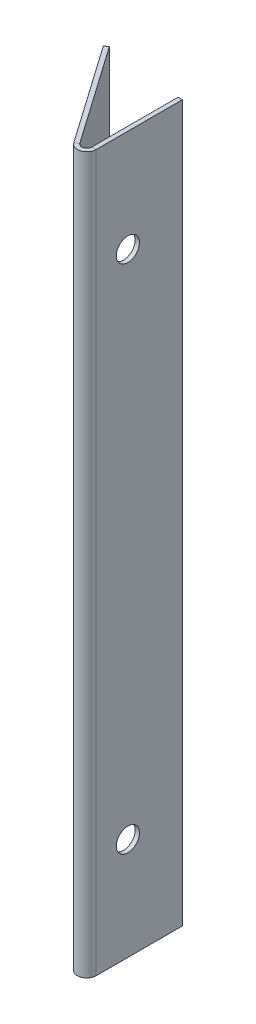
ISO-10303-21;
HEADER;
FILE_DESCRIPTION(('STEP AP214'),'2;1');
FILE_NAME('part.step','',(''),(''),'','','');
FILE_SCHEMA(('AUTOMOTIVE_DESIGN { 1 0 10303 214 1 1 1 1 }'));
ENDSEC;
DATA;
#1=APPLICATION_CONTEXT('core data for automotive mechanical design processes');
#2=APPLICATION_PROTOCOL_DEFINITION('international standard','automotive_design',2000,#1);
#3=PRODUCT_CONTEXT('',#1,'mechanical');
#4=PRODUCT('Part','Part','',(#3));
#5=PRODUCT_RELATED_PRODUCT_CATEGORY('part','',(#4));
#6=PRODUCT_DEFINITION_FORMATION('','',#4);
#7=PRODUCT_DEFINITION_CONTEXT('part definition',#1,'design');
#8=PRODUCT_DEFINITION('design','',#6,#7);
#9=PRODUCT_DEFINITION_SHAPE('','',#8);
#10=(LENGTH_UNIT() NAMED_UNIT(*) SI_UNIT(.MILLI.,.METRE.));
#11=(NAMED_UNIT(*) PLANE_ANGLE_UNIT() SI_UNIT($,.RADIAN.));
#12=(NAMED_UNIT(*) SI_UNIT($,.STERADIAN.) SOLID_ANGLE_UNIT());
#13=UNCERTAINTY_MEASURE_WITH_UNIT(LENGTH_MEASURE(1.E-05),#10,'distance_accuracy_value','');
#14=(GEOMETRIC_REPRESENTATION_CONTEXT(3) GLOBAL_UNCERTAINTY_ASSIGNED_CONTEXT((#13)) GLOBAL_UNIT_ASSIGNED_CONTEXT((#10,
#11,#12)) REPRESENTATION_CONTEXT('',''));
#15=CARTESIAN_POINT('',(0.,0.,0.));
#16=DIRECTION('',(0.,0.,1.));
#17=DIRECTION('',(1.,0.,0.));
#18=AXIS2_PLACEMENT_3D('',#15,#16,#17);
#19=CARTESIAN_POINT('',(-0.946252943629408,0.,0.662573444182441));
#20=DIRECTION('',(-0.819152044288991,0.,0.573576436351047));
#21=DIRECTION('',(0.573576436351047,0.,0.819152044288991));
#22=AXIS2_PLACEMENT_3D('',#19,#20,#21);
#23=PLANE('',#22);
#24=CARTESIAN_POINT('',(-6.31164463133152,-15.,-7.00000000000001));
#25=DIRECTION('',(-0.819152044288991,0.,0.573576436351047));
#26=DIRECTION('',(0.573576436351047,0.,0.819152044288991));
#27=AXIS2_PLACEMENT_3D('',#24,#25,#26);
#28=ELLIPSE('',#27,3.66232376628437,3.);
#29=CARTESIAN_POINT('',(-6.18412947346153,-17.9944675251264,-6.81788948145859));
#30=VERTEX_POINT('',#29);
#31=CARTESIAN_POINT('',(-6.18412947346153,-12.0055324748736,-6.81788948145859));
#32=VERTEX_POINT('',#31);
#33=EDGE_CURVE('E53',#30,#32,#28,.F.);
#34=ORIENTED_EDGE('',*,*,#33,.T.);
#35=CARTESIAN_POINT('',(-6.0566143155915,-15.,-6.6357789629171));
#36=DIRECTION('',(-0.819152044288991,0.,0.573576436351047));
#37=DIRECTION('',(0.573576436351047,0.,0.819152044288991));
#38=AXIS2_PLACEMENT_3D('',#35,#36,#37);
#39=ELLIPSE('',#38,3.66232376628437,3.);
#40=EDGE_CURVE('E131',#32,#30,#39,.F.);
#41=ORIENTED_EDGE('',*,*,#40,.T.);
#42=EDGE_LOOP('',(#34,#41));
#43=FACE_BOUND('',#42,.T.);
#44=CARTESIAN_POINT('',(-6.31164463133152,-90.,-7.00000000000002));
#45=DIRECTION('',(-0.819152044288991,0.,0.573576436351047));
#46=DIRECTION('',(0.573576436351047,0.,0.819152044288991));
#47=AXIS2_PLACEMENT_3D('',#44,#45,#46);
#48=ELLIPSE('',#47,3.66232376628437,3.);
#49=CARTESIAN_POINT('',(-6.1841294734616,-92.9944675251264,-6.81788948145869));
#50=VERTEX_POINT('',#49);
#51=CARTESIAN_POINT('',(-6.1841294734616,-87.0055324748736,-6.81788948145869));
#52=VERTEX_POINT('',#51);
#53=EDGE_CURVE('E165',#50,#52,#48,.F.);
#54=ORIENTED_EDGE('',*,*,#53,.T.);
#55=CARTESIAN_POINT('',(-6.0566143155915,-90.,-6.63577896291711));
#56=DIRECTION('',(-0.819152044288991,0.,0.573576436351047));
#57=DIRECTION('',(0.573576436351047,0.,0.819152044288991));
#58=AXIS2_PLACEMENT_3D('',#55,#56,#57);
#59=ELLIPSE('',#58,3.66232376628437,3.);
#60=EDGE_CURVE('E143',#52,#50,#59,.F.);
#61=ORIENTED_EDGE('',*,*,#60,.T.);
#62=EDGE_LOOP('',(#54,#61));
#63=FACE_BOUND('',#62,.T.);
#64=DIRECTION('',(-0.573576436351047,0.,-0.819152044288991));
#65=VECTOR('',#64,1.);
#66=CARTESIAN_POINT('',(-12.6266902751445,-105.,-16.0188198486969));
#67=LINE('',#66,#65);
#68=CARTESIAN_POINT('',(-2.49514894394678,-105.,-1.54947929132165));
#69=VERTEX_POINT('',#68);
#70=CARTESIAN_POINT('',(-12.6266902751445,-105.,-16.0188198486969));
#71=VERTEX_POINT('',#70);
#72=EDGE_CURVE('E195',#69,#71,#67,.T.);
#73=ORIENTED_EDGE('',*,*,#72,.F.);
#74=DIRECTION('',(0.,1.,0.));
#75=VECTOR('',#74,1.);
#76=CARTESIAN_POINT('',(-2.49514894394678,0.,-1.54947929132164));
#77=LINE('',#76,#75);
#78=CARTESIAN_POINT('',(-2.49514894394678,0.,-1.54947929132164));
#79=VERTEX_POINT('',#78);
#80=EDGE_CURVE('E189',#69,#79,#77,.T.);
#81=ORIENTED_EDGE('',*,*,#80,.T.);
#82=DIRECTION('',(0.573576436351047,0.,0.819152044288991));
#83=VECTOR('',#82,1.);
#84=CARTESIAN_POINT('',(-1.15516154812351,0.,0.364221037082915));
#85=LINE('',#84,#83);
#86=CARTESIAN_POINT('',(-12.6266902751445,0.,-16.0188198486969));
#87=VERTEX_POINT('',#86);
#88=EDGE_CURVE('E201',#87,#79,#85,.T.);
#89=ORIENTED_EDGE('',*,*,#88,.F.);
#90=DIRECTION('',(0.,1.,0.));
#91=VECTOR('',#90,1.);
#92=CARTESIAN_POINT('',(-12.6266902751445,0.,-16.0188198486969));
#93=LINE('',#92,#91);
#94=EDGE_CURVE('E197',#71,#87,#93,.T.);
#95=ORIENTED_EDGE('',*,*,#94,.F.);
#96=EDGE_LOOP('',(#73,#81,#89,#95));
#97=FACE_BOUND('',#96,.T.);
#98=ADVANCED_FACE('F38',(#43,#63,#97),#23,.T.);
#99=CARTESIAN_POINT('',(-0.426091395505899,0.,0.298352407099526));
#100=DIRECTION('',(-0.819152044288991,0.,0.573576436351047));
#101=DIRECTION('',(0.573576436351047,0.,0.819152044288991));
#102=AXIS2_PLACEMENT_3D('',#99,#100,#101);
#103=PLANE('',#102);
#104=CARTESIAN_POINT('',(-5.53645276746799,-15.,-7.00000000000001));
#105=DIRECTION('',(-0.819152044288991,0.,0.573576436351047));
#106=DIRECTION('',(0.573576436351047,0.,0.819152044288991));
#107=AXIS2_PLACEMENT_3D('',#104,#105,#106);
#108=ELLIPSE('',#107,3.66232376628437,3.);
#109=CARTESIAN_POINT('',(-5.66396792533802,-12.0055324748736,-7.1821105185415));
#110=VERTEX_POINT('',#109);
#111=CARTESIAN_POINT('',(-5.66396792533802,-17.9944675251264,-7.1821105185415));
#112=VERTEX_POINT('',#111);
#113=EDGE_CURVE('E134',#110,#112,#108,.F.);
#114=ORIENTED_EDGE('',*,*,#113,.F.);
#115=CARTESIAN_POINT('',(-5.79148308320801,-15.,-7.36422103708293));
#116=DIRECTION('',(-0.819152044288991,0.,0.573576436351047));
#117=DIRECTION('',(0.573576436351047,0.,0.819152044288991));
#118=AXIS2_PLACEMENT_3D('',#115,#116,#117);
#119=ELLIPSE('',#118,3.66232376628437,3.);
#120=EDGE_CURVE('E58',#112,#110,#119,.F.);
#121=ORIENTED_EDGE('',*,*,#120,.F.);
#122=EDGE_LOOP('',(#114,#121));
#123=FACE_BOUND('',#122,.T.);
#124=CARTESIAN_POINT('',(-5.53645276746799,-90.,-7.00000000000002));
#125=DIRECTION('',(-0.819152044288991,0.,0.573576436351047));
#126=DIRECTION('',(0.573576436351047,0.,0.819152044288991));
#127=AXIS2_PLACEMENT_3D('',#124,#125,#126);
#128=ELLIPSE('',#127,3.66232376628437,3.);
#129=CARTESIAN_POINT('',(-5.66396792533809,-87.0055324748736,-7.18211051854161));
#130=VERTEX_POINT('',#129);
#131=CARTESIAN_POINT('',(-5.66396792533809,-92.9944675251264,-7.18211051854161));
#132=VERTEX_POINT('',#131);
#133=EDGE_CURVE('E138',#130,#132,#128,.F.);
#134=ORIENTED_EDGE('',*,*,#133,.F.);
#135=CARTESIAN_POINT('',(-5.79148308320801,-90.,-7.36422103708294));
#136=DIRECTION('',(-0.819152044288991,0.,0.573576436351047));
#137=DIRECTION('',(0.573576436351047,0.,0.819152044288991));
#138=AXIS2_PLACEMENT_3D('',#135,#136,#137);
#139=ELLIPSE('',#138,3.66232376628437,3.);
#140=EDGE_CURVE('E166',#132,#130,#139,.F.);
#141=ORIENTED_EDGE('',*,*,#140,.F.);
#142=EDGE_LOOP('',(#134,#141));
#143=FACE_BOUND('',#142,.T.);
#144=DIRECTION('',(0.,1.,0.));
#145=VECTOR('',#144,1.);
#146=CARTESIAN_POINT('',(-1.97498739582327,-105.,-1.91370032840457));
#147=LINE('',#146,#145);
#148=CARTESIAN_POINT('',(-1.97498739582327,-105.,-1.91370032840456));
#149=VERTEX_POINT('',#148);
#150=CARTESIAN_POINT('',(-1.97498739582327,0.,-1.91370032840456));
#151=VERTEX_POINT('',#150);
#152=EDGE_CURVE('E184',#149,#151,#147,.T.);
#153=ORIENTED_EDGE('',*,*,#152,.F.);
#154=DIRECTION('',(-0.573576436351047,0.,-0.819152044288991));
#155=VECTOR('',#154,1.);
#156=CARTESIAN_POINT('',(-12.1065287270209,-105.,-16.3830408857798));
#157=LINE('',#156,#155);
#158=CARTESIAN_POINT('',(-12.1065287270209,-105.,-16.3830408857798));
#159=VERTEX_POINT('',#158);
#160=EDGE_CURVE('E194',#149,#159,#157,.T.);
#161=ORIENTED_EDGE('',*,*,#160,.T.);
#162=DIRECTION('',(0.,1.,0.));
#163=VECTOR('',#162,1.);
#164=CARTESIAN_POINT('',(-12.1065287270209,0.,-16.3830408857798));
#165=LINE('',#164,#163);
#166=CARTESIAN_POINT('',(-12.1065287270209,0.,-16.3830408857798));
#167=VERTEX_POINT('',#166);
#168=EDGE_CURVE('E206',#159,#167,#165,.T.);
#169=ORIENTED_EDGE('',*,*,#168,.T.);
#170=DIRECTION('',(0.573576436351047,0.,0.819152044288991));
#171=VECTOR('',#170,1.);
#172=CARTESIAN_POINT('',(-0.635,0.,0.));
#173=LINE('',#172,#171);
#174=EDGE_CURVE('E198',#167,#151,#173,.T.);
#175=ORIENTED_EDGE('',*,*,#174,.T.);
#176=EDGE_LOOP('',(#153,#161,#169,#175));
#177=FACE_BOUND('',#176,.T.);
#178=ADVANCED_FACE('F289',(#123,#143,#177),#103,.F.);
#179=CARTESIAN_POINT('',(-0.635,0.,0.));
#180=DIRECTION('',(1.,0.,0.));
#181=DIRECTION('',(0.,0.,-1.));
#182=AXIS2_PLACEMENT_3D('',#179,#180,#181);
#183=PLANE('',#182);
#184=CARTESIAN_POINT('',(-0.635,-15.,-7.00000000000001));
#185=DIRECTION('',(1.,0.,0.));
#186=DIRECTION('',(0.,0.,-1.));
#187=AXIS2_PLACEMENT_3D('',#184,#185,#186);
#188=CIRCLE('',#187,1.7);
#189=CARTESIAN_POINT('',(-0.635,-15.,-8.70000000000001));
#190=VERTEX_POINT('',#189);
#191=EDGE_CURVE('E178',#190,#190,#188,.T.);
#192=ORIENTED_EDGE('',*,*,#191,.T.);
#193=EDGE_LOOP('',(#192));
#194=FACE_BOUND('',#193,.T.);
#195=DIRECTION('',(0.,1.,0.));
#196=VECTOR('',#195,1.);
#197=CARTESIAN_POINT('',(-0.635000000000015,0.,-2.33619673142073));
#198=LINE('',#197,#196);
#199=CARTESIAN_POINT('',(-0.635000000000015,0.,-2.33619673142073));
#200=VERTEX_POINT('',#199);
#201=CARTESIAN_POINT('',(-0.635000000000015,-105.,-2.33619673142073));
#202=VERTEX_POINT('',#201);
#203=EDGE_CURVE('E229',#200,#202,#198,.F.);
#204=ORIENTED_EDGE('',*,*,#203,.F.);
#205=DIRECTION('',(0.,0.,1.));
#206=VECTOR('',#205,1.);
#207=CARTESIAN_POINT('',(-0.635,0.,0.));
#208=LINE('',#207,#206);
#209=CARTESIAN_POINT('',(-0.635,0.,-15.));
#210=VERTEX_POINT('',#209);
#211=EDGE_CURVE('E245',#210,#200,#208,.T.);
#212=ORIENTED_EDGE('',*,*,#211,.F.);
#213=DIRECTION('',(0.,1.,0.));
#214=VECTOR('',#213,1.);
#215=CARTESIAN_POINT('',(-0.635,0.,-15.));
#216=LINE('',#215,#214);
#217=CARTESIAN_POINT('',(-0.635,-105.,-15.));
#218=VERTEX_POINT('',#217);
#219=EDGE_CURVE('E241',#218,#210,#216,.T.);
#220=ORIENTED_EDGE('',*,*,#219,.F.);
#221=DIRECTION('',(0.,0.,-1.));
#222=VECTOR('',#221,1.);
#223=CARTESIAN_POINT('',(-0.635,-105.,0.));
#224=LINE('',#223,#222);
#225=EDGE_CURVE('E239',#202,#218,#224,.T.);
#226=ORIENTED_EDGE('',*,*,#225,.F.);
#227=EDGE_LOOP('',(#204,#212,#220,#226));
#228=FACE_BOUND('',#227,.T.);
#229=CARTESIAN_POINT('',(-0.635,-90.,-7.00000000000002));
#230=DIRECTION('',(1.,0.,0.));
#231=DIRECTION('',(0.,0.,-1.));
#232=AXIS2_PLACEMENT_3D('',#229,#230,#231);
#233=CIRCLE('',#232,1.7);
#234=CARTESIAN_POINT('',(-0.635,-90.,-8.70000000000003));
#235=VERTEX_POINT('',#234);
#236=EDGE_CURVE('E172',#235,#235,#233,.T.);
#237=ORIENTED_EDGE('',*,*,#236,.T.);
#238=EDGE_LOOP('',(#237));
#239=FACE_BOUND('',#238,.T.);
#240=ADVANCED_FACE('F272',(#194,#228,#239),#183,.F.);
#241=CARTESIAN_POINT('',(0.,0.,0.));
#242=DIRECTION('',(1.,0.,0.));
#243=DIRECTION('',(0.,0.,-1.));
#244=AXIS2_PLACEMENT_3D('',#241,#242,#243);
#245=PLANE('',#244);
#246=CARTESIAN_POINT('',(0.,-15.,-7.00000000000001));
#247=DIRECTION('',(1.,0.,0.));
#248=DIRECTION('',(0.,0.,-1.));
#249=AXIS2_PLACEMENT_3D('',#246,#247,#248);
#250=CIRCLE('',#249,1.7);
#251=CARTESIAN_POINT('',(0.,-15.,-8.70000000000001));
#252=VERTEX_POINT('',#251);
#253=EDGE_CURVE('E175',#252,#252,#250,.T.);
#254=ORIENTED_EDGE('',*,*,#253,.F.);
#255=EDGE_LOOP('',(#254));
#256=FACE_BOUND('',#255,.T.);
#257=DIRECTION('',(0.,0.,1.));
#258=VECTOR('',#257,1.);
#259=CARTESIAN_POINT('',(0.,0.,0.));
#260=LINE('',#259,#258);
#261=CARTESIAN_POINT('',(0.,0.,-15.));
#262=VERTEX_POINT('',#261);
#263=CARTESIAN_POINT('',(0.,0.,-2.33619673142073));
#264=VERTEX_POINT('',#263);
#265=EDGE_CURVE('E242',#262,#264,#260,.T.);
#266=ORIENTED_EDGE('',*,*,#265,.T.);
#267=DIRECTION('',(0.,1.,0.));
#268=VECTOR('',#267,1.);
#269=CARTESIAN_POINT('',(0.,0.,-2.33619673142073));
#270=LINE('',#269,#268);
#271=CARTESIAN_POINT('',(0.,-105.,-2.33619673142073));
#272=VERTEX_POINT('',#271);
#273=EDGE_CURVE('E216',#264,#272,#270,.F.);
#274=ORIENTED_EDGE('',*,*,#273,.T.);
#275=DIRECTION('',(0.,0.,-1.));
#276=VECTOR('',#275,1.);
#277=CARTESIAN_POINT('',(0.,-105.,0.));
#278=LINE('',#277,#276);
#279=CARTESIAN_POINT('',(0.,-105.,-15.));
#280=VERTEX_POINT('',#279);
#281=EDGE_CURVE('E236',#272,#280,#278,.T.);
#282=ORIENTED_EDGE('',*,*,#281,.T.);
#283=DIRECTION('',(0.,1.,0.));
#284=VECTOR('',#283,1.);
#285=CARTESIAN_POINT('',(0.,0.,-15.));
#286=LINE('',#285,#284);
#287=EDGE_CURVE('E249',#280,#262,#286,.T.);
#288=ORIENTED_EDGE('',*,*,#287,.T.);
#289=EDGE_LOOP('',(#266,#274,#282,#288));
#290=FACE_BOUND('',#289,.T.);
#291=CARTESIAN_POINT('',(0.,-90.,-7.00000000000002));
#292=DIRECTION('',(1.,0.,0.));
#293=DIRECTION('',(0.,0.,-1.));
#294=AXIS2_PLACEMENT_3D('',#291,#292,#293);
#295=CIRCLE('',#294,1.7);
#296=CARTESIAN_POINT('',(0.,-90.,-8.70000000000003));
#297=VERTEX_POINT('',#296);
#298=EDGE_CURVE('E168',#297,#297,#295,.T.);
#299=ORIENTED_EDGE('',*,*,#298,.F.);
#300=EDGE_LOOP('',(#299));
#301=FACE_BOUND('',#300,.T.);
#302=ADVANCED_FACE('F255',(#256,#290,#301),#245,.T.);
#303=CARTESIAN_POINT('',(-0.635,0.,0.));
#304=DIRECTION('',(0.,1.,0.));
#305=DIRECTION('',(0.,0.,1.));
#306=AXIS2_PLACEMENT_3D('',#303,#304,#305);
#307=PLANE('',#306);
#308=ORIENTED_EDGE('',*,*,#211,.T.);
#309=DIRECTION('',(1.,0.,0.));
#310=VECTOR('',#309,1.);
#311=CARTESIAN_POINT('',(-0.635000000000015,0.,-2.33619673142073));
#312=LINE('',#311,#310);
#313=EDGE_CURVE('E223',#200,#264,#312,.T.);
#314=ORIENTED_EDGE('',*,*,#313,.T.);
#315=ORIENTED_EDGE('',*,*,#265,.F.);
#316=DIRECTION('',(1.,0.,0.));
#317=VECTOR('',#316,1.);
#318=CARTESIAN_POINT('',(-0.635,0.,-15.));
#319=LINE('',#318,#317);
#320=EDGE_CURVE('E11',#210,#262,#319,.T.);
#321=ORIENTED_EDGE('',*,*,#320,.F.);
#322=EDGE_LOOP('',(#308,#314,#315,#321));
#323=FACE_BOUND('',#322,.T.);
#324=ADVANCED_FACE('F260',(#323),#307,.T.);
#325=CARTESIAN_POINT('',(-0.635,0.,-15.));
#326=DIRECTION('',(0.,0.,-1.));
#327=DIRECTION('',(0.,1.,0.));
#328=AXIS2_PLACEMENT_3D('',#325,#326,#327);
#329=PLANE('',#328);
#330=ORIENTED_EDGE('',*,*,#287,.F.);
#331=DIRECTION('',(1.,0.,0.));
#332=VECTOR('',#331,1.);
#333=CARTESIAN_POINT('',(-0.635,-105.,-15.));
#334=LINE('',#333,#332);
#335=EDGE_CURVE('E42',#218,#280,#334,.T.);
#336=ORIENTED_EDGE('',*,*,#335,.F.);
#337=ORIENTED_EDGE('',*,*,#219,.T.);
#338=ORIENTED_EDGE('',*,*,#320,.T.);
#339=EDGE_LOOP('',(#330,#336,#337,#338));
#340=FACE_BOUND('',#339,.T.);
#341=ADVANCED_FACE('F280',(#340),#329,.T.);
#342=CARTESIAN_POINT('',(-0.635,-105.,0.));
#343=DIRECTION('',(0.,-1.,0.));
#344=DIRECTION('',(0.,0.,-1.));
#345=AXIS2_PLACEMENT_3D('',#342,#343,#344);
#346=PLANE('',#345);
#347=DIRECTION('',(1.,0.,0.));
#348=VECTOR('',#347,1.);
#349=CARTESIAN_POINT('',(-0.635000000000015,-105.,-2.33619673142073));
#350=LINE('',#349,#348);
#351=EDGE_CURVE('E233',#202,#272,#350,.T.);
#352=ORIENTED_EDGE('',*,*,#351,.F.);
#353=ORIENTED_EDGE('',*,*,#225,.T.);
#354=ORIENTED_EDGE('',*,*,#335,.T.);
#355=ORIENTED_EDGE('',*,*,#281,.F.);
#356=EDGE_LOOP('',(#352,#353,#354,#355));
#357=FACE_BOUND('',#356,.T.);
#358=ADVANCED_FACE('F40',(#357),#346,.T.);
#359=CARTESIAN_POINT('',(-1.37160000000001,-105.,-2.33619673142074));
#360=DIRECTION('',(0.,-1.,0.));
#361=DIRECTION('',(0.,0.,-1.));
#362=AXIS2_PLACEMENT_3D('',#359,#360,#361);
#363=PLANE('',#362);
#364=DIRECTION('',(-0.819152044288991,0.,0.573576436351047));
#365=VECTOR('',#364,1.);
#366=CARTESIAN_POINT('',(-1.97498739582327,-105.,-1.91370032840457));
#367=LINE('',#366,#365);
#368=EDGE_CURVE('E181',#149,#69,#367,.T.);
#369=ORIENTED_EDGE('',*,*,#368,.F.);
#370=CARTESIAN_POINT('',(-1.37160000000001,-105.,-2.33619673142074));
#371=DIRECTION('',(0.,1.,0.));
#372=DIRECTION('',(0.,0.,1.));
#373=AXIS2_PLACEMENT_3D('',#370,#371,#372);
#374=CIRCLE('',#373,0.73659999999999);
#375=EDGE_CURVE('E226',#202,#149,#374,.F.);
#376=ORIENTED_EDGE('',*,*,#375,.F.);
#377=ORIENTED_EDGE('',*,*,#351,.T.);
#378=CARTESIAN_POINT('',(-1.37160000000001,-105.,-2.33619673142074));
#379=DIRECTION('',(0.,1.,0.));
#380=DIRECTION('',(0.,0.,1.));
#381=AXIS2_PLACEMENT_3D('',#378,#379,#380);
#382=CIRCLE('',#381,1.37159999999999);
#383=EDGE_CURVE('E219',#272,#69,#382,.F.);
#384=ORIENTED_EDGE('',*,*,#383,.T.);
#385=EDGE_LOOP('',(#369,#376,#377,#384));
#386=FACE_BOUND('',#385,.T.);
#387=ADVANCED_FACE('F286',(#386),#363,.T.);
#388=CARTESIAN_POINT('',(-1.37160000000001,0.,-2.33619673142074));
#389=DIRECTION('',(0.,-1.,0.));
#390=DIRECTION('',(0.,0.,-1.));
#391=AXIS2_PLACEMENT_3D('',#388,#389,#390);
#392=PLANE('',#391);
#393=CARTESIAN_POINT('',(-1.37160000000001,0.,-2.33619673142074));
#394=DIRECTION('',(0.,1.,0.));
#395=DIRECTION('',(0.,0.,1.));
#396=AXIS2_PLACEMENT_3D('',#393,#394,#395);
#397=CIRCLE('',#396,0.73659999999999);
#398=EDGE_CURVE('E213',#151,#200,#397,.T.);
#399=ORIENTED_EDGE('',*,*,#398,.F.);
#400=DIRECTION('',(-0.819152044288991,0.,0.573576436351047));
#401=VECTOR('',#400,1.);
#402=CARTESIAN_POINT('',(-1.97498739582327,0.,-1.91370032840455));
#403=LINE('',#402,#401);
#404=EDGE_CURVE('E186',#151,#79,#403,.T.);
#405=ORIENTED_EDGE('',*,*,#404,.T.);
#406=CARTESIAN_POINT('',(-1.37160000000001,0.,-2.33619673142074));
#407=DIRECTION('',(0.,1.,0.));
#408=DIRECTION('',(0.,0.,1.));
#409=AXIS2_PLACEMENT_3D('',#406,#407,#408);
#410=CIRCLE('',#409,1.37159999999999);
#411=EDGE_CURVE('E220',#79,#264,#410,.T.);
#412=ORIENTED_EDGE('',*,*,#411,.T.);
#413=ORIENTED_EDGE('',*,*,#313,.F.);
#414=EDGE_LOOP('',(#399,#405,#412,#413));
#415=FACE_BOUND('',#414,.T.);
#416=ADVANCED_FACE('F264',(#415),#392,.F.);
#417=CARTESIAN_POINT('',(-1.37160000000001,0.,-2.33619673142074));
#418=DIRECTION('',(0.,1.,0.));
#419=DIRECTION('',(-0.819152044288991,0.,0.573576436351047));
#420=AXIS2_PLACEMENT_3D('',#417,#418,#419);
#421=CYLINDRICAL_SURFACE('',#420,1.37159999999999);
#422=ORIENTED_EDGE('',*,*,#273,.F.);
#423=ORIENTED_EDGE('',*,*,#411,.F.);
#424=ORIENTED_EDGE('',*,*,#80,.F.);
#425=ORIENTED_EDGE('',*,*,#383,.F.);
#426=EDGE_LOOP('',(#422,#423,#424,#425));
#427=FACE_BOUND('',#426,.T.);
#428=ADVANCED_FACE('F311',(#427),#421,.T.);
#429=CARTESIAN_POINT('',(-1.37160000000001,0.,-2.33619673142074));
#430=DIRECTION('',(0.,1.,0.));
#431=DIRECTION('',(-0.819152044288991,0.,0.573576436351047));
#432=AXIS2_PLACEMENT_3D('',#429,#430,#431);
#433=CYLINDRICAL_SURFACE('',#432,0.73659999999999);
#434=ORIENTED_EDGE('',*,*,#203,.T.);
#435=ORIENTED_EDGE('',*,*,#375,.T.);
#436=ORIENTED_EDGE('',*,*,#152,.T.);
#437=ORIENTED_EDGE('',*,*,#398,.T.);
#438=EDGE_LOOP('',(#434,#435,#436,#437));
#439=FACE_BOUND('',#438,.T.);
#440=ADVANCED_FACE('F267',(#439),#433,.F.);
#441=CARTESIAN_POINT('',(-1.15516154812351,0.,0.364221037082915));
#442=DIRECTION('',(0.,1.,0.));
#443=DIRECTION('',(0.,0.,1.));
#444=AXIS2_PLACEMENT_3D('',#441,#442,#443);
#445=PLANE('',#444);
#446=ORIENTED_EDGE('',*,*,#88,.T.);
#447=ORIENTED_EDGE('',*,*,#404,.F.);
#448=ORIENTED_EDGE('',*,*,#174,.F.);
#449=DIRECTION('',(0.819152044288991,0.,-0.573576436351047));
#450=VECTOR('',#449,1.);
#451=CARTESIAN_POINT('',(-12.6266902751445,0.,-16.0188198486969));
#452=LINE('',#451,#450);
#453=EDGE_CURVE('E211',#87,#167,#452,.T.);
#454=ORIENTED_EDGE('',*,*,#453,.F.);
#455=EDGE_LOOP('',(#446,#447,#448,#454));
#456=FACE_BOUND('',#455,.T.);
#457=ADVANCED_FACE('F299',(#456),#445,.T.);
#458=CARTESIAN_POINT('',(-12.6266902751445,-105.,-16.0188198486969));
#459=DIRECTION('',(0.,-1.,0.));
#460=DIRECTION('',(1.,0.,0.));
#461=AXIS2_PLACEMENT_3D('',#458,#459,#460);
#462=PLANE('',#461);
#463=ORIENTED_EDGE('',*,*,#160,.F.);
#464=ORIENTED_EDGE('',*,*,#368,.T.);
#465=ORIENTED_EDGE('',*,*,#72,.T.);
#466=DIRECTION('',(0.819152044288991,0.,-0.573576436351047));
#467=VECTOR('',#466,1.);
#468=CARTESIAN_POINT('',(-12.6266902751445,-105.,-16.0188198486969));
#469=LINE('',#468,#467);
#470=EDGE_CURVE('E204',#71,#159,#469,.T.);
#471=ORIENTED_EDGE('',*,*,#470,.T.);
#472=EDGE_LOOP('',(#463,#464,#465,#471));
#473=FACE_BOUND('',#472,.T.);
#474=ADVANCED_FACE('F302',(#473),#462,.T.);
#475=CARTESIAN_POINT('',(-12.6266902751445,0.,-16.0188198486969));
#476=DIRECTION('',(-0.573576436351047,0.,-0.819152044288991));
#477=DIRECTION('',(-0.819152044288991,0.,0.573576436351047));
#478=AXIS2_PLACEMENT_3D('',#475,#476,#477);
#479=PLANE('',#478);
#480=ORIENTED_EDGE('',*,*,#168,.F.);
#481=ORIENTED_EDGE('',*,*,#470,.F.);
#482=ORIENTED_EDGE('',*,*,#94,.T.);
#483=ORIENTED_EDGE('',*,*,#453,.T.);
#484=EDGE_LOOP('',(#480,#481,#482,#483));
#485=FACE_BOUND('',#484,.T.);
#486=ADVANCED_FACE('F304',(#485),#479,.T.);
#487=CARTESIAN_POINT('',(0.,-15.,-7.00000000000001));
#488=DIRECTION('',(1.,0.,0.));
#489=DIRECTION('',(0.,0.,-1.));
#490=AXIS2_PLACEMENT_3D('',#487,#488,#489);
#491=CYLINDRICAL_SURFACE('',#490,1.7);
#492=ORIENTED_EDGE('',*,*,#191,.F.);
#493=EDGE_LOOP('',(#492));
#494=FACE_BOUND('',#493,.T.);
#495=ORIENTED_EDGE('',*,*,#253,.T.);
#496=EDGE_LOOP('',(#495));
#497=FACE_BOUND('',#496,.T.);
#498=ADVANCED_FACE('F297',(#494,#497),#491,.F.);
#499=CARTESIAN_POINT('',(0.,-90.,-7.00000000000002));
#500=DIRECTION('',(1.,0.,0.));
#501=DIRECTION('',(0.,0.,-1.));
#502=AXIS2_PLACEMENT_3D('',#499,#500,#501);
#503=CYLINDRICAL_SURFACE('',#502,1.7);
#504=ORIENTED_EDGE('',*,*,#236,.F.);
#505=EDGE_LOOP('',(#504));
#506=FACE_BOUND('',#505,.T.);
#507=ORIENTED_EDGE('',*,*,#298,.T.);
#508=EDGE_LOOP('',(#507));
#509=FACE_BOUND('',#508,.T.);
#510=ADVANCED_FACE('F332',(#506,#509),#503,.F.);
#511=CARTESIAN_POINT('',(-6.31164463133152,-90.,-7.00000000000002));
#512=DIRECTION('',(-0.819152044288991,0.,0.573576436351047));
#513=DIRECTION('',(0.573576436351047,0.,0.819152044288991));
#514=AXIS2_PLACEMENT_3D('',#511,#512,#513);
#515=ELLIPSE('',#514,3.66232376628437,3.);
#516=DIRECTION('',(-0.819152044288991,0.,0.573576436351047));
#517=VECTOR('',#516,1.);
#518=SURFACE_OF_LINEAR_EXTRUSION('',#515,#517);
#519=DIRECTION('',(-0.819152044288991,0.,0.573576436351047));
#520=VECTOR('',#519,1.);
#521=CARTESIAN_POINT('',(-5.663967925338,-87.0055324748736,-7.18211051854148));
#522=LINE('',#521,#520);
#523=EDGE_CURVE('E163',#130,#52,#522,.T.);
#524=ORIENTED_EDGE('',*,*,#523,.T.);
#525=ORIENTED_EDGE('',*,*,#53,.F.);
#526=DIRECTION('',(-0.819152044288991,0.,0.573576436351047));
#527=VECTOR('',#526,1.);
#528=CARTESIAN_POINT('',(-5.66396792533801,-92.9944675251264,-7.1821105185415));
#529=LINE('',#528,#527);
#530=EDGE_CURVE('E160',#50,#132,#529,.F.);
#531=ORIENTED_EDGE('',*,*,#530,.T.);
#532=ORIENTED_EDGE('',*,*,#140,.T.);
#533=EDGE_LOOP('',(#524,#525,#531,#532));
#534=FACE_BOUND('',#533,.T.);
#535=ADVANCED_FACE('F154',(#534),#518,.F.);
#536=CARTESIAN_POINT('',(-5.53645276746799,-90.,-7.00000000000002));
#537=DIRECTION('',(-0.819152044288991,0.,0.573576436351047));
#538=DIRECTION('',(0.573576436351047,0.,0.819152044288991));
#539=AXIS2_PLACEMENT_3D('',#536,#537,#538);
#540=ELLIPSE('',#539,3.66232376628437,3.);
#541=DIRECTION('',(-0.819152044288991,0.,0.573576436351047));
#542=VECTOR('',#541,1.);
#543=SURFACE_OF_LINEAR_EXTRUSION('',#540,#542);
#544=ORIENTED_EDGE('',*,*,#133,.T.);
#545=ORIENTED_EDGE('',*,*,#530,.F.);
#546=ORIENTED_EDGE('',*,*,#60,.F.);
#547=ORIENTED_EDGE('',*,*,#523,.F.);
#548=EDGE_LOOP('',(#544,#545,#546,#547));
#549=FACE_BOUND('',#548,.T.);
#550=ADVANCED_FACE('F149',(#549),#543,.F.);
#551=CARTESIAN_POINT('',(-6.31164463133152,-15.,-7.00000000000001));
#552=DIRECTION('',(-0.819152044288991,0.,0.573576436351047));
#553=DIRECTION('',(0.573576436351047,0.,0.819152044288991));
#554=AXIS2_PLACEMENT_3D('',#551,#552,#553);
#555=ELLIPSE('',#554,3.66232376628437,3.);
#556=DIRECTION('',(-0.819152044288991,0.,0.573576436351047));
#557=VECTOR('',#556,1.);
#558=SURFACE_OF_LINEAR_EXTRUSION('',#555,#557);
#559=DIRECTION('',(-0.819152044288991,0.,0.573576436351047));
#560=VECTOR('',#559,1.);
#561=CARTESIAN_POINT('',(-5.663967925338,-12.0055324748736,-7.18211051854147));
#562=LINE('',#561,#560);
#563=EDGE_CURVE('E123',#110,#32,#562,.T.);
#564=ORIENTED_EDGE('',*,*,#563,.T.);
#565=ORIENTED_EDGE('',*,*,#33,.F.);
#566=DIRECTION('',(-0.819152044288991,0.,0.573576436351047));
#567=VECTOR('',#566,1.);
#568=CARTESIAN_POINT('',(-5.663967925338,-17.9944675251264,-7.18211051854148));
#569=LINE('',#568,#567);
#570=EDGE_CURVE('E128',#30,#112,#569,.F.);
#571=ORIENTED_EDGE('',*,*,#570,.T.);
#572=ORIENTED_EDGE('',*,*,#120,.T.);
#573=EDGE_LOOP('',(#564,#565,#571,#572));
#574=FACE_BOUND('',#573,.T.);
#575=ADVANCED_FACE('F125',(#574),#558,.F.);
#576=CARTESIAN_POINT('',(-5.53645276746799,-15.,-7.00000000000001));
#577=DIRECTION('',(-0.819152044288991,0.,0.573576436351047));
#578=DIRECTION('',(0.573576436351047,0.,0.819152044288991));
#579=AXIS2_PLACEMENT_3D('',#576,#577,#578);
#580=ELLIPSE('',#579,3.66232376628437,3.);
#581=DIRECTION('',(-0.819152044288991,0.,0.573576436351047));
#582=VECTOR('',#581,1.);
#583=SURFACE_OF_LINEAR_EXTRUSION('',#580,#582);
#584=ORIENTED_EDGE('',*,*,#113,.T.);
#585=ORIENTED_EDGE('',*,*,#570,.F.);
#586=ORIENTED_EDGE('',*,*,#40,.F.);
#587=ORIENTED_EDGE('',*,*,#563,.F.);
#588=EDGE_LOOP('',(#584,#585,#586,#587));
#589=FACE_BOUND('',#588,.T.);
#590=ADVANCED_FACE('F132',(#589),#583,.F.);
#591=CLOSED_SHELL('',(#98,#178,#240,#302,#324,#341,#358,#387,#416,#428,#440,#457,#474,#486,#498,
#510,#535,#550,#575,#590));
#592=MANIFOLD_SOLID_BREP('B2',#591);
#593=ADVANCED_BREP_SHAPE_REPRESENTATION('',(#18,#592),#14);
#594=SHAPE_DEFINITION_REPRESENTATION(#9,#593);
ENDSEC;
END-ISO-10303-21;
